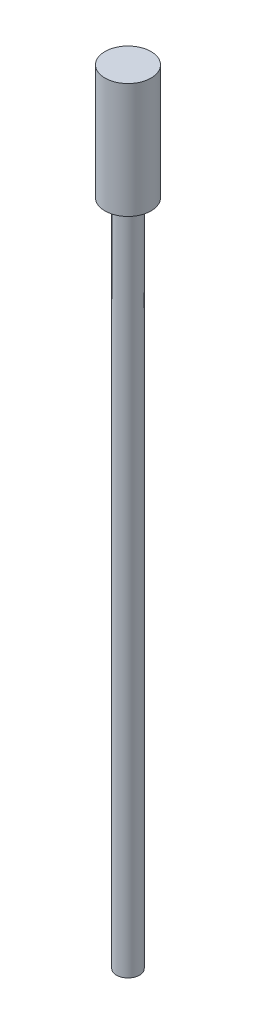
ISO-10303-21;
HEADER;
FILE_DESCRIPTION(('STEP AP214'),'2;1');
FILE_NAME('part.step','',(''),(''),'','','');
FILE_SCHEMA(('AUTOMOTIVE_DESIGN { 1 0 10303 214 1 1 1 1 }'));
ENDSEC;
DATA;
#1=APPLICATION_CONTEXT('core data for automotive mechanical design processes');
#2=APPLICATION_PROTOCOL_DEFINITION('international standard','automotive_design',2000,#1);
#3=PRODUCT_CONTEXT('',#1,'mechanical');
#4=PRODUCT('Part','Part','',(#3));
#5=PRODUCT_RELATED_PRODUCT_CATEGORY('part','',(#4));
#6=PRODUCT_DEFINITION_FORMATION('','',#4);
#7=PRODUCT_DEFINITION_CONTEXT('part definition',#1,'design');
#8=PRODUCT_DEFINITION('design','',#6,#7);
#9=PRODUCT_DEFINITION_SHAPE('','',#8);
#10=(LENGTH_UNIT() NAMED_UNIT(*) SI_UNIT(.MILLI.,.METRE.));
#11=(NAMED_UNIT(*) PLANE_ANGLE_UNIT() SI_UNIT($,.RADIAN.));
#12=(NAMED_UNIT(*) SI_UNIT($,.STERADIAN.) SOLID_ANGLE_UNIT());
#13=UNCERTAINTY_MEASURE_WITH_UNIT(LENGTH_MEASURE(1.E-05),#10,'distance_accuracy_value','');
#14=(GEOMETRIC_REPRESENTATION_CONTEXT(3) GLOBAL_UNCERTAINTY_ASSIGNED_CONTEXT((#13)) GLOBAL_UNIT_ASSIGNED_CONTEXT((#10,
#11,#12)) REPRESENTATION_CONTEXT('',''));
#15=CARTESIAN_POINT('',(0.,0.,0.));
#16=DIRECTION('',(0.,0.,1.));
#17=DIRECTION('',(1.,0.,0.));
#18=AXIS2_PLACEMENT_3D('',#15,#16,#17);
#19=CARTESIAN_POINT('',(0.25,0.,0.));
#20=DIRECTION('',(0.,1.,0.));
#21=DIRECTION('',(-1.,0.,0.));
#22=AXIS2_PLACEMENT_3D('',#19,#20,#21);
#23=PLANE('',#22);
#24=CARTESIAN_POINT('',(0.,0.,0.));
#25=DIRECTION('',(0.,1.,0.));
#26=DIRECTION('',(-1.,0.,0.));
#27=AXIS2_PLACEMENT_3D('',#24,#25,#26);
#28=CIRCLE('',#27,0.5);
#29=CARTESIAN_POINT('',(-0.5,0.,0.));
#30=VERTEX_POINT('',#29);
#31=EDGE_CURVE('E10',#30,#30,#28,.T.);
#32=ORIENTED_EDGE('',*,*,#31,.F.);
#33=EDGE_LOOP('',(#32));
#34=FACE_BOUND('',#33,.T.);
#35=CARTESIAN_POINT('',(0.,0.,0.));
#36=DIRECTION('',(0.,1.,0.));
#37=DIRECTION('',(-1.,0.,0.));
#38=AXIS2_PLACEMENT_3D('',#35,#36,#37);
#39=CIRCLE('',#38,0.25);
#40=CARTESIAN_POINT('',(-0.25,0.,0.));
#41=VERTEX_POINT('',#40);
#42=EDGE_CURVE('E44',#41,#41,#39,.T.);
#43=ORIENTED_EDGE('',*,*,#42,.T.);
#44=EDGE_LOOP('',(#43));
#45=FACE_BOUND('',#44,.T.);
#46=ADVANCED_FACE('F30',(#34,#45),#23,.F.);
#47=CARTESIAN_POINT('',(0.,3.35,0.));
#48=DIRECTION('',(0.,1.,0.));
#49=DIRECTION('',(-1.,0.,0.));
#50=AXIS2_PLACEMENT_3D('',#47,#48,#49);
#51=CYLINDRICAL_SURFACE('',#50,0.5);
#52=CARTESIAN_POINT('',(0.,2.5,0.));
#53=DIRECTION('',(0.,1.,0.));
#54=DIRECTION('',(-1.,0.,0.));
#55=AXIS2_PLACEMENT_3D('',#52,#53,#54);
#56=CIRCLE('',#55,0.499999999999999);
#57=CARTESIAN_POINT('',(-0.499999999999999,2.5,0.));
#58=VERTEX_POINT('',#57);
#59=EDGE_CURVE('E36',#58,#58,#56,.T.);
#60=ORIENTED_EDGE('',*,*,#59,.F.);
#61=EDGE_LOOP('',(#60));
#62=FACE_BOUND('',#61,.T.);
#63=ORIENTED_EDGE('',*,*,#31,.T.);
#64=EDGE_LOOP('',(#63));
#65=FACE_BOUND('',#64,.T.);
#66=ADVANCED_FACE('F64',(#62,#65),#51,.T.);
#67=CARTESIAN_POINT('',(0.5,2.5,0.));
#68=DIRECTION('',(0.,-1.,0.));
#69=DIRECTION('',(1.,0.,0.));
#70=AXIS2_PLACEMENT_3D('',#67,#68,#69);
#71=PLANE('',#70);
#72=ORIENTED_EDGE('',*,*,#59,.T.);
#73=EDGE_LOOP('',(#72));
#74=FACE_BOUND('',#73,.T.);
#75=ADVANCED_FACE('F59',(#74),#71,.F.);
#76=CARTESIAN_POINT('',(0.,-14.5,0.));
#77=DIRECTION('',(0.,1.,0.));
#78=DIRECTION('',(-1.,0.,0.));
#79=AXIS2_PLACEMENT_3D('',#76,#77,#78);
#80=PLANE('',#79);
#81=CARTESIAN_POINT('',(0.,-14.5,0.));
#82=DIRECTION('',(0.,1.,0.));
#83=DIRECTION('',(-1.,0.,0.));
#84=AXIS2_PLACEMENT_3D('',#81,#82,#83);
#85=CIRCLE('',#84,0.250000000000003);
#86=CARTESIAN_POINT('',(-0.250000000000005,-14.5,0.));
#87=VERTEX_POINT('',#86);
#88=EDGE_CURVE('E40',#87,#87,#85,.T.);
#89=ORIENTED_EDGE('',*,*,#88,.F.);
#90=EDGE_LOOP('',(#89));
#91=FACE_BOUND('',#90,.T.);
#92=ADVANCED_FACE('F54',(#91),#80,.F.);
#93=CARTESIAN_POINT('',(0.,3.35,0.));
#94=DIRECTION('',(0.,1.,0.));
#95=DIRECTION('',(-1.,0.,0.));
#96=AXIS2_PLACEMENT_3D('',#93,#94,#95);
#97=CYLINDRICAL_SURFACE('',#96,0.250000000000001);
#98=ORIENTED_EDGE('',*,*,#42,.F.);
#99=EDGE_LOOP('',(#98));
#100=FACE_BOUND('',#99,.T.);
#101=ORIENTED_EDGE('',*,*,#88,.T.);
#102=EDGE_LOOP('',(#101));
#103=FACE_BOUND('',#102,.T.);
#104=ADVANCED_FACE('F51',(#100,#103),#97,.T.);
#105=CLOSED_SHELL('',(#46,#66,#75,#92,#104));
#106=MANIFOLD_SOLID_BREP('B2',#105);
#107=ADVANCED_BREP_SHAPE_REPRESENTATION('',(#18,#106),#14);
#108=SHAPE_DEFINITION_REPRESENTATION(#9,#107);
ENDSEC;
END-ISO-10303-21;
